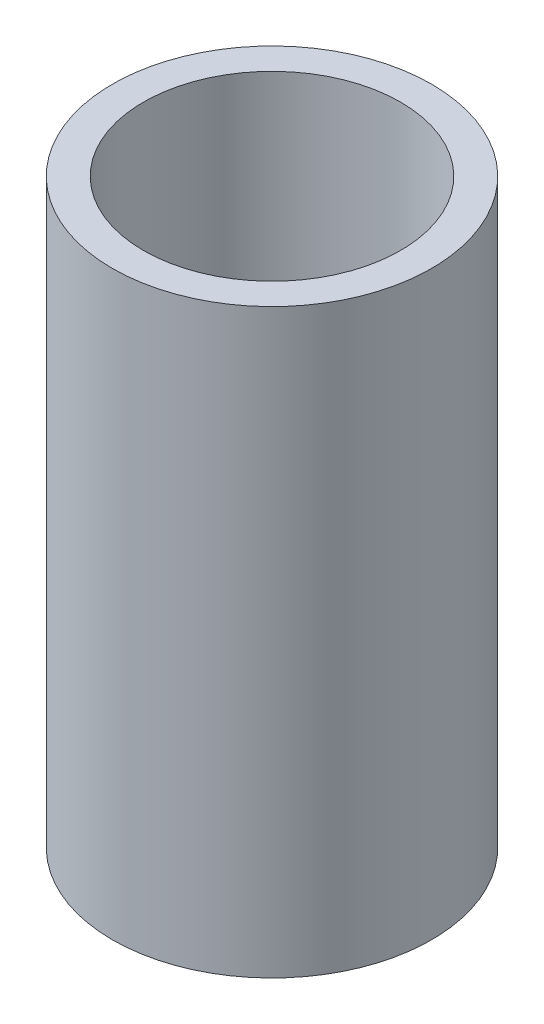
ISO-10303-21;
HEADER;
FILE_DESCRIPTION(('STEP AP214'),'2;1');
FILE_NAME('part.step','',(''),(''),'','','');
FILE_SCHEMA(('AUTOMOTIVE_DESIGN { 1 0 10303 214 1 1 1 1 }'));
ENDSEC;
DATA;
#1=APPLICATION_CONTEXT('core data for automotive mechanical design processes');
#2=APPLICATION_PROTOCOL_DEFINITION('international standard','automotive_design',2000,#1);
#3=PRODUCT_CONTEXT('',#1,'mechanical');
#4=PRODUCT('Part','Part','',(#3));
#5=PRODUCT_RELATED_PRODUCT_CATEGORY('part','',(#4));
#6=PRODUCT_DEFINITION_FORMATION('','',#4);
#7=PRODUCT_DEFINITION_CONTEXT('part definition',#1,'design');
#8=PRODUCT_DEFINITION('design','',#6,#7);
#9=PRODUCT_DEFINITION_SHAPE('','',#8);
#10=(LENGTH_UNIT() NAMED_UNIT(*) SI_UNIT(.MILLI.,.METRE.));
#11=(NAMED_UNIT(*) PLANE_ANGLE_UNIT() SI_UNIT($,.RADIAN.));
#12=(NAMED_UNIT(*) SI_UNIT($,.STERADIAN.) SOLID_ANGLE_UNIT());
#13=UNCERTAINTY_MEASURE_WITH_UNIT(LENGTH_MEASURE(1.E-05),#10,'distance_accuracy_value','');
#14=(GEOMETRIC_REPRESENTATION_CONTEXT(3) GLOBAL_UNCERTAINTY_ASSIGNED_CONTEXT((#13)) GLOBAL_UNIT_ASSIGNED_CONTEXT((#10,
#11,#12)) REPRESENTATION_CONTEXT('',''));
#15=CARTESIAN_POINT('',(0.,0.,0.));
#16=DIRECTION('',(0.,0.,1.));
#17=DIRECTION('',(1.,0.,0.));
#18=AXIS2_PLACEMENT_3D('',#15,#16,#17);
#19=CARTESIAN_POINT('',(0.,81.9700411339923,0.));
#20=DIRECTION('',(0.,-1.,0.));
#21=DIRECTION('',(0.,0.,-1.));
#22=AXIS2_PLACEMENT_3D('',#19,#20,#21);
#23=CYLINDRICAL_SURFACE('',#22,22.5);
#24=CARTESIAN_POINT('',(0.,81.9700411339923,0.));
#25=DIRECTION('',(0.,1.,0.));
#26=DIRECTION('',(0.,0.,1.));
#27=AXIS2_PLACEMENT_3D('',#24,#25,#26);
#28=CIRCLE('',#27,22.5);
#29=CARTESIAN_POINT('',(0.,81.9700411339923,22.5));
#30=VERTEX_POINT('',#29);
#31=EDGE_CURVE('E10',#30,#30,#28,.T.);
#32=ORIENTED_EDGE('',*,*,#31,.F.);
#33=EDGE_LOOP('',(#32));
#34=FACE_BOUND('',#33,.T.);
#35=CARTESIAN_POINT('',(0.,0.,0.));
#36=DIRECTION('',(0.,1.,0.));
#37=DIRECTION('',(0.,0.,1.));
#38=AXIS2_PLACEMENT_3D('',#35,#36,#37);
#39=CIRCLE('',#38,22.5);
#40=CARTESIAN_POINT('',(0.,0.,22.5));
#41=VERTEX_POINT('',#40);
#42=EDGE_CURVE('E37',#41,#41,#39,.T.);
#43=ORIENTED_EDGE('',*,*,#42,.T.);
#44=EDGE_LOOP('',(#43));
#45=FACE_BOUND('',#44,.T.);
#46=ADVANCED_FACE('F40',(#34,#45),#23,.T.);
#47=CARTESIAN_POINT('',(0.,81.9700411339923,0.));
#48=DIRECTION('',(0.,1.,0.));
#49=DIRECTION('',(0.,0.,1.));
#50=AXIS2_PLACEMENT_3D('',#47,#48,#49);
#51=PLANE('',#50);
#52=CARTESIAN_POINT('',(0.,81.9700411339923,0.));
#53=DIRECTION('',(0.,1.,0.));
#54=DIRECTION('',(0.,0.,1.));
#55=AXIS2_PLACEMENT_3D('',#52,#53,#54);
#56=CIRCLE('',#55,18.1239234466579);
#57=CARTESIAN_POINT('',(0.,81.9700411339923,18.1239234466579));
#58=VERTEX_POINT('',#57);
#59=EDGE_CURVE('E50',#58,#58,#56,.T.);
#60=ORIENTED_EDGE('',*,*,#59,.F.);
#61=EDGE_LOOP('',(#60));
#62=FACE_BOUND('',#61,.T.);
#63=ORIENTED_EDGE('',*,*,#31,.T.);
#64=EDGE_LOOP('',(#63));
#65=FACE_BOUND('',#64,.T.);
#66=ADVANCED_FACE('F59',(#62,#65),#51,.T.);
#67=CARTESIAN_POINT('',(0.,0.,0.));
#68=DIRECTION('',(0.,1.,0.));
#69=DIRECTION('',(0.,0.,1.));
#70=AXIS2_PLACEMENT_3D('',#67,#68,#69);
#71=PLANE('',#70);
#72=CARTESIAN_POINT('',(0.,0.,0.));
#73=DIRECTION('',(0.,1.,0.));
#74=DIRECTION('',(0.,0.,1.));
#75=AXIS2_PLACEMENT_3D('',#72,#73,#74);
#76=CIRCLE('',#75,18.1239234466579);
#77=CARTESIAN_POINT('',(0.,0.,18.1239234466579));
#78=VERTEX_POINT('',#77);
#79=EDGE_CURVE('E47',#78,#78,#76,.T.);
#80=ORIENTED_EDGE('',*,*,#79,.T.);
#81=EDGE_LOOP('',(#80));
#82=FACE_BOUND('',#81,.T.);
#83=ORIENTED_EDGE('',*,*,#42,.F.);
#84=EDGE_LOOP('',(#83));
#85=FACE_BOUND('',#84,.T.);
#86=ADVANCED_FACE('F58',(#82,#85),#71,.F.);
#87=CARTESIAN_POINT('',(0.,81.9700411339923,0.));
#88=DIRECTION('',(0.,-1.,0.));
#89=DIRECTION('',(0.,0.,-1.));
#90=AXIS2_PLACEMENT_3D('',#87,#88,#89);
#91=CYLINDRICAL_SURFACE('',#90,18.1239234466579);
#92=ORIENTED_EDGE('',*,*,#59,.T.);
#93=EDGE_LOOP('',(#92));
#94=FACE_BOUND('',#93,.T.);
#95=ORIENTED_EDGE('',*,*,#79,.F.);
#96=EDGE_LOOP('',(#95));
#97=FACE_BOUND('',#96,.T.);
#98=ADVANCED_FACE('F54',(#94,#97),#91,.F.);
#99=CLOSED_SHELL('',(#46,#66,#86,#98));
#100=MANIFOLD_SOLID_BREP('B2',#99);
#101=ADVANCED_BREP_SHAPE_REPRESENTATION('',(#18,#100),#14);
#102=SHAPE_DEFINITION_REPRESENTATION(#9,#101);
ENDSEC;
END-ISO-10303-21;
